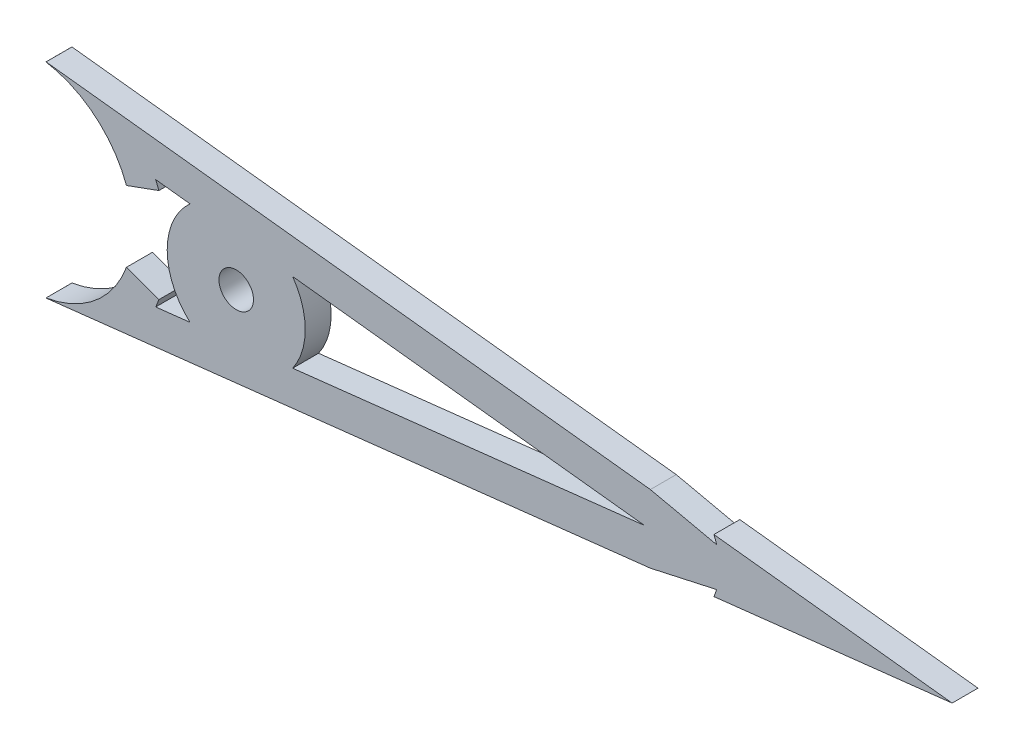
ISO-10303-21;
HEADER;
FILE_DESCRIPTION(('STEP AP214'),'2;1');
FILE_NAME('part.step','',(''),(''),'','','');
FILE_SCHEMA(('AUTOMOTIVE_DESIGN { 1 0 10303 214 1 1 1 1 }'));
ENDSEC;
DATA;
#1=APPLICATION_CONTEXT('core data for automotive mechanical design processes');
#2=APPLICATION_PROTOCOL_DEFINITION('international standard','automotive_design',2000,#1);
#3=PRODUCT_CONTEXT('',#1,'mechanical');
#4=PRODUCT('Part','Part','',(#3));
#5=PRODUCT_RELATED_PRODUCT_CATEGORY('part','',(#4));
#6=PRODUCT_DEFINITION_FORMATION('','',#4);
#7=PRODUCT_DEFINITION_CONTEXT('part definition',#1,'design');
#8=PRODUCT_DEFINITION('design','',#6,#7);
#9=PRODUCT_DEFINITION_SHAPE('','',#8);
#10=(LENGTH_UNIT() NAMED_UNIT(*) SI_UNIT(.MILLI.,.METRE.));
#11=(NAMED_UNIT(*) PLANE_ANGLE_UNIT() SI_UNIT($,.RADIAN.));
#12=(NAMED_UNIT(*) SI_UNIT($,.STERADIAN.) SOLID_ANGLE_UNIT());
#13=UNCERTAINTY_MEASURE_WITH_UNIT(LENGTH_MEASURE(1.E-05),#10,'distance_accuracy_value','');
#14=(GEOMETRIC_REPRESENTATION_CONTEXT(3) GLOBAL_UNCERTAINTY_ASSIGNED_CONTEXT((#13)) GLOBAL_UNIT_ASSIGNED_CONTEXT((#10,
#11,#12)) REPRESENTATION_CONTEXT('',''));
#15=CARTESIAN_POINT('',(0.,0.,0.));
#16=DIRECTION('',(0.,0.,1.));
#17=DIRECTION('',(1.,0.,0.));
#18=AXIS2_PLACEMENT_3D('',#15,#16,#17);
#19=CARTESIAN_POINT('',(-38.1,0.,-4.7625));
#20=DIRECTION('',(0.,0.,1.));
#21=DIRECTION('',(1.,0.,0.));
#22=AXIS2_PLACEMENT_3D('',#19,#20,#21);
#23=CYLINDRICAL_SURFACE('',#22,25.4);
#24=CARTESIAN_POINT('',(-38.1,0.,0.));
#25=DIRECTION('',(0.,0.,1.));
#26=DIRECTION('',(1.,0.,0.));
#27=AXIS2_PLACEMENT_3D('',#24,#25,#26);
#28=CIRCLE('',#27,25.4);
#29=CARTESIAN_POINT('',(-14.2318074320379,8.68731164047184,0.));
#30=VERTEX_POINT('',#29);
#31=CARTESIAN_POINT('',(-14.817170454314,10.1523321629333,0.));
#32=VERTEX_POINT('',#31);
#33=EDGE_CURVE('E248',#30,#32,#28,.T.);
#34=ORIENTED_EDGE('',*,*,#33,.F.);
#35=DIRECTION('',(0.,0.,1.));
#36=VECTOR('',#35,1.);
#37=CARTESIAN_POINT('',(-14.2318074320379,8.68731164047184,-4.7625));
#38=LINE('',#37,#36);
#39=CARTESIAN_POINT('',(-14.2318074320379,8.68731164047184,-4.7625));
#40=VERTEX_POINT('',#39);
#41=EDGE_CURVE('E383',#40,#30,#38,.T.);
#42=ORIENTED_EDGE('',*,*,#41,.F.);
#43=CARTESIAN_POINT('',(-38.1,0.,-4.7625));
#44=DIRECTION('',(0.,0.,1.));
#45=DIRECTION('',(1.,0.,0.));
#46=AXIS2_PLACEMENT_3D('',#43,#44,#45);
#47=CIRCLE('',#46,25.4);
#48=CARTESIAN_POINT('',(-14.817170454314,10.1523321629333,-4.7625));
#49=VERTEX_POINT('',#48);
#50=EDGE_CURVE('E252',#40,#49,#47,.T.);
#51=ORIENTED_EDGE('',*,*,#50,.T.);
#52=DIRECTION('',(0.,0.,1.));
#53=VECTOR('',#52,1.);
#54=CARTESIAN_POINT('',(-14.817170454314,10.1523321629333,-4.7625));
#55=LINE('',#54,#53);
#56=EDGE_CURVE('E318',#49,#32,#55,.T.);
#57=ORIENTED_EDGE('',*,*,#56,.T.);
#58=EDGE_LOOP('',(#34,#42,#51,#57));
#59=FACE_BOUND('',#58,.T.);
#60=ADVANCED_FACE('F49',(#59),#23,.T.);
#61=CARTESIAN_POINT('',(-20.1988555740284,6.51548373035388,-4.7625));
#62=DIRECTION('',(0.342020143325663,-0.93969262078591,0.));
#63=DIRECTION('',(0.939692620785911,0.342020143325663,0.));
#64=AXIS2_PLACEMENT_3D('',#61,#62,#63);
#65=PLANE('',#64);
#66=DIRECTION('',(0.93969262078591,0.342020143325663,0.));
#67=VECTOR('',#66,1.);
#68=CARTESIAN_POINT('',(-20.1988555740284,6.51548373035388,0.));
#69=LINE('',#68,#67);
#70=CARTESIAN_POINT('',(-20.1988555740284,6.51548373035388,0.));
#71=VERTEX_POINT('',#70);
#72=EDGE_CURVE('E257',#71,#30,#69,.T.);
#73=ORIENTED_EDGE('',*,*,#72,.F.);
#74=DIRECTION('',(0.,0.,1.));
#75=VECTOR('',#74,1.);
#76=CARTESIAN_POINT('',(-20.1988555740284,6.51548373035388,-4.7625));
#77=LINE('',#76,#75);
#78=CARTESIAN_POINT('',(-20.1988555740284,6.51548373035388,-4.7625));
#79=VERTEX_POINT('',#78);
#80=EDGE_CURVE('E387',#79,#71,#77,.T.);
#81=ORIENTED_EDGE('',*,*,#80,.F.);
#82=DIRECTION('',(0.93969262078591,0.342020143325663,0.));
#83=VECTOR('',#82,1.);
#84=CARTESIAN_POINT('',(-20.1988555740284,6.51548373035388,-4.7625));
#85=LINE('',#84,#83);
#86=EDGE_CURVE('E314',#79,#40,#85,.T.);
#87=ORIENTED_EDGE('',*,*,#86,.T.);
#88=ORIENTED_EDGE('',*,*,#41,.T.);
#89=EDGE_LOOP('',(#73,#81,#87,#88));
#90=FACE_BOUND('',#89,.T.);
#91=ADVANCED_FACE('F482',(#90),#65,.T.);
#92=CARTESIAN_POINT('',(-38.1,0.,-4.7625));
#93=DIRECTION('',(0.,0.,1.));
#94=DIRECTION('',(1.,0.,0.));
#95=AXIS2_PLACEMENT_3D('',#92,#93,#94);
#96=CYLINDRICAL_SURFACE('',#95,19.05);
#97=CARTESIAN_POINT('',(-38.1,0.,0.));
#98=DIRECTION('',(0.,0.,-1.));
#99=DIRECTION('',(1.,0.,0.));
#100=AXIS2_PLACEMENT_3D('',#97,#98,#99);
#101=CIRCLE('',#100,19.05);
#102=CARTESIAN_POINT('',(-34.9890417711435,18.7942661175772,0.));
#103=VERTEX_POINT('',#102);
#104=EDGE_CURVE('E377',#103,#71,#101,.T.);
#105=ORIENTED_EDGE('',*,*,#104,.F.);
#106=DIRECTION('',(0.,0.,1.));
#107=VECTOR('',#106,1.);
#108=CARTESIAN_POINT('',(-34.9890417711435,18.7942661175772,-4.7625));
#109=LINE('',#108,#107);
#110=CARTESIAN_POINT('',(-34.9890417711435,18.7942661175772,-4.7625));
#111=VERTEX_POINT('',#110);
#112=EDGE_CURVE('E439',#103,#111,#109,.F.);
#113=ORIENTED_EDGE('',*,*,#112,.T.);
#114=CARTESIAN_POINT('',(-38.1,0.,-4.7625));
#115=DIRECTION('',(0.,0.,-1.));
#116=DIRECTION('',(1.,0.,0.));
#117=AXIS2_PLACEMENT_3D('',#114,#115,#116);
#118=CIRCLE('',#117,19.05);
#119=EDGE_CURVE('E311',#111,#79,#118,.T.);
#120=ORIENTED_EDGE('',*,*,#119,.T.);
#121=ORIENTED_EDGE('',*,*,#80,.T.);
#122=EDGE_LOOP('',(#105,#113,#120,#121));
#123=FACE_BOUND('',#122,.T.);
#124=ADVANCED_FACE('F530',(#123),#96,.F.);
#125=CARTESIAN_POINT('',(76.2,6.26799297339507,-4.7625));
#126=DIRECTION('',(0.112174693389171,0.99368850157534,0.));
#127=DIRECTION('',(-0.99368850157534,0.112174693389171,0.));
#128=AXIS2_PLACEMENT_3D('',#125,#126,#127);
#129=PLANE('',#128);
#130=DIRECTION('',(-0.99368850157534,0.112174693389171,0.));
#131=VECTOR('',#130,1.);
#132=CARTESIAN_POINT('',(76.2,6.26799297339507,-4.7625));
#133=LINE('',#132,#131);
#134=CARTESIAN_POINT('',(76.2,6.26799297339507,-4.7625));
#135=VERTEX_POINT('',#134);
#136=CARTESIAN_POINT('',(-34.985543180385,18.8194154722923,-4.7625));
#137=VERTEX_POINT('',#136);
#138=EDGE_CURVE('E307',#135,#137,#133,.T.);
#139=ORIENTED_EDGE('',*,*,#138,.T.);
#140=DIRECTION('',(0.,0.,1.));
#141=VECTOR('',#140,1.);
#142=CARTESIAN_POINT('',(-34.9855431803849,18.8194154722923,-4.7625));
#143=LINE('',#142,#141);
#144=CARTESIAN_POINT('',(-34.985543180385,18.8194154722923,0.));
#145=VERTEX_POINT('',#144);
#146=EDGE_CURVE('E386',#137,#145,#143,.T.);
#147=ORIENTED_EDGE('',*,*,#146,.T.);
#148=DIRECTION('',(-0.99368850157534,0.112174693389171,0.));
#149=VECTOR('',#148,1.);
#150=CARTESIAN_POINT('',(76.2,6.26799297339507,0.));
#151=LINE('',#150,#149);
#152=CARTESIAN_POINT('',(76.2,6.26799297339507,0.));
#153=VERTEX_POINT('',#152);
#154=EDGE_CURVE('E373',#153,#145,#151,.T.);
#155=ORIENTED_EDGE('',*,*,#154,.F.);
#156=DIRECTION('',(0.,0.,1.));
#157=VECTOR('',#156,1.);
#158=CARTESIAN_POINT('',(76.2,6.26799297339507,-4.7625));
#159=LINE('',#158,#157);
#160=EDGE_CURVE('E391',#135,#153,#159,.T.);
#161=ORIENTED_EDGE('',*,*,#160,.F.);
#162=EDGE_LOOP('',(#139,#147,#155,#161));
#163=FACE_BOUND('',#162,.T.);
#164=ADVANCED_FACE('F493',(#163),#129,.T.);
#165=CARTESIAN_POINT('',(76.2,6.26799297339507,-4.7625));
#166=DIRECTION('',(0.215428920718154,0.976519523674878,0.));
#167=DIRECTION('',(-0.976519523674878,0.215428920718154,0.));
#168=AXIS2_PLACEMENT_3D('',#165,#166,#167);
#169=PLANE('',#168);
#170=DIRECTION('',(-0.976519523674878,0.215428920718154,0.));
#171=VECTOR('',#170,1.);
#172=CARTESIAN_POINT('',(76.2,6.26799297339507,0.));
#173=LINE('',#172,#171);
#174=CARTESIAN_POINT('',(88.3850123983999,3.5798705075522,0.));
#175=VERTEX_POINT('',#174);
#176=EDGE_CURVE('E369',#175,#153,#173,.T.);
#177=ORIENTED_EDGE('',*,*,#176,.F.);
#178=DIRECTION('',(0.,0.,1.));
#179=VECTOR('',#178,1.);
#180=CARTESIAN_POINT('',(88.3850123983999,3.5798705075522,-4.7625));
#181=LINE('',#180,#179);
#182=CARTESIAN_POINT('',(88.3850123983999,3.5798705075522,-4.7625));
#183=VERTEX_POINT('',#182);
#184=EDGE_CURVE('E394',#183,#175,#181,.T.);
#185=ORIENTED_EDGE('',*,*,#184,.F.);
#186=DIRECTION('',(-0.976519523674878,0.215428920718154,0.));
#187=VECTOR('',#186,1.);
#188=CARTESIAN_POINT('',(76.2,6.26799297339507,-4.7625));
#189=LINE('',#188,#187);
#190=EDGE_CURVE('E303',#183,#135,#189,.T.);
#191=ORIENTED_EDGE('',*,*,#190,.T.);
#192=ORIENTED_EDGE('',*,*,#160,.T.);
#193=EDGE_LOOP('',(#177,#185,#191,#192));
#194=FACE_BOUND('',#193,.T.);
#195=ADVANCED_FACE('F498',(#194),#169,.T.);
#196=CARTESIAN_POINT('',(76.2,0.,-4.7625));
#197=DIRECTION('',(0.,0.,1.));
#198=DIRECTION('',(1.,0.,0.));
#199=AXIS2_PLACEMENT_3D('',#196,#197,#198);
#200=CYLINDRICAL_SURFACE('',#199,12.7);
#201=CARTESIAN_POINT('',(76.2,0.,0.));
#202=DIRECTION('',(0.,0.,-1.));
#203=DIRECTION('',(1.,0.,0.));
#204=AXIS2_PLACEMENT_3D('',#201,#202,#203);
#205=CIRCLE('',#204,12.7);
#206=CARTESIAN_POINT('',(87.8966374651163,4.94759254684929,0.));
#207=VERTEX_POINT('',#206);
#208=EDGE_CURVE('E365',#207,#175,#205,.T.);
#209=ORIENTED_EDGE('',*,*,#208,.F.);
#210=DIRECTION('',(0.,0.,1.));
#211=VECTOR('',#210,1.);
#212=CARTESIAN_POINT('',(87.8966374651163,4.94759254684929,-4.7625));
#213=LINE('',#212,#211);
#214=CARTESIAN_POINT('',(87.8966374651163,4.94759254684929,-4.7625));
#215=VERTEX_POINT('',#214);
#216=EDGE_CURVE('E397',#215,#207,#213,.T.);
#217=ORIENTED_EDGE('',*,*,#216,.F.);
#218=CARTESIAN_POINT('',(76.2,0.,-4.7625));
#219=DIRECTION('',(0.,0.,-1.));
#220=DIRECTION('',(1.,0.,0.));
#221=AXIS2_PLACEMENT_3D('',#218,#219,#220);
#222=CIRCLE('',#221,12.7);
#223=EDGE_CURVE('E299',#215,#183,#222,.T.);
#224=ORIENTED_EDGE('',*,*,#223,.T.);
#225=ORIENTED_EDGE('',*,*,#184,.T.);
#226=EDGE_LOOP('',(#209,#217,#224,#225));
#227=FACE_BOUND('',#226,.T.);
#228=ADVANCED_FACE('F503',(#227),#200,.F.);
#229=CARTESIAN_POINT('',(131.7244,0.,-4.7625));
#230=DIRECTION('',(0.112174693389171,0.993688501575341,0.));
#231=DIRECTION('',(-0.993688501575341,0.112174693389171,0.));
#232=AXIS2_PLACEMENT_3D('',#229,#230,#231);
#233=PLANE('',#232);
#234=DIRECTION('',(-0.99368850157534,0.112174693389171,0.));
#235=VECTOR('',#234,1.);
#236=CARTESIAN_POINT('',(131.7244,0.,0.));
#237=LINE('',#236,#235);
#238=CARTESIAN_POINT('',(131.7244,0.,0.));
#239=VERTEX_POINT('',#238);
#240=EDGE_CURVE('E361',#239,#207,#237,.T.);
#241=ORIENTED_EDGE('',*,*,#240,.F.);
#242=DIRECTION('',(0.,0.,1.));
#243=VECTOR('',#242,1.);
#244=CARTESIAN_POINT('',(131.7244,0.,-4.7625));
#245=LINE('',#244,#243);
#246=CARTESIAN_POINT('',(131.7244,0.,-4.7625));
#247=VERTEX_POINT('',#246);
#248=EDGE_CURVE('E400',#247,#239,#245,.T.);
#249=ORIENTED_EDGE('',*,*,#248,.F.);
#250=DIRECTION('',(-0.99368850157534,0.112174693389171,0.));
#251=VECTOR('',#250,1.);
#252=CARTESIAN_POINT('',(131.7244,0.,-4.7625));
#253=LINE('',#252,#251);
#254=EDGE_CURVE('E295',#247,#215,#253,.T.);
#255=ORIENTED_EDGE('',*,*,#254,.T.);
#256=ORIENTED_EDGE('',*,*,#216,.T.);
#257=EDGE_LOOP('',(#241,#249,#255,#256));
#258=FACE_BOUND('',#257,.T.);
#259=ADVANCED_FACE('F506',(#258),#233,.T.);
#260=CARTESIAN_POINT('',(131.7244,0.,-4.7625));
#261=DIRECTION('',(0.112174693389171,-0.993688501575341,0.));
#262=DIRECTION('',(0.99368850157534,0.112174693389171,0.));
#263=AXIS2_PLACEMENT_3D('',#260,#261,#262);
#264=PLANE('',#263);
#265=DIRECTION('',(0.99368850157534,0.112174693389171,0.));
#266=VECTOR('',#265,1.);
#267=CARTESIAN_POINT('',(131.7244,0.,0.));
#268=LINE('',#267,#266);
#269=CARTESIAN_POINT('',(87.8966374651163,-4.9475925468493,0.));
#270=VERTEX_POINT('',#269);
#271=EDGE_CURVE('E357',#270,#239,#268,.T.);
#272=ORIENTED_EDGE('',*,*,#271,.F.);
#273=DIRECTION('',(0.,0.,1.));
#274=VECTOR('',#273,1.);
#275=CARTESIAN_POINT('',(87.8966374651163,-4.9475925468493,-4.7625));
#276=LINE('',#275,#274);
#277=CARTESIAN_POINT('',(87.8966374651163,-4.9475925468493,-4.7625));
#278=VERTEX_POINT('',#277);
#279=EDGE_CURVE('E403',#278,#270,#276,.T.);
#280=ORIENTED_EDGE('',*,*,#279,.F.);
#281=DIRECTION('',(0.99368850157534,0.112174693389171,0.));
#282=VECTOR('',#281,1.);
#283=CARTESIAN_POINT('',(131.7244,0.,-4.7625));
#284=LINE('',#283,#282);
#285=EDGE_CURVE('E291',#278,#247,#284,.T.);
#286=ORIENTED_EDGE('',*,*,#285,.T.);
#287=ORIENTED_EDGE('',*,*,#248,.T.);
#288=EDGE_LOOP('',(#272,#280,#286,#287));
#289=FACE_BOUND('',#288,.T.);
#290=ADVANCED_FACE('F511',(#289),#264,.T.);
#291=CARTESIAN_POINT('',(76.2,0.,-4.7625));
#292=DIRECTION('',(0.,0.,1.));
#293=DIRECTION('',(1.,0.,0.));
#294=AXIS2_PLACEMENT_3D('',#291,#292,#293);
#295=CYLINDRICAL_SURFACE('',#294,12.7);
#296=CARTESIAN_POINT('',(76.2,0.,0.));
#297=DIRECTION('',(0.,0.,-1.));
#298=DIRECTION('',(1.,0.,0.));
#299=AXIS2_PLACEMENT_3D('',#296,#297,#298);
#300=CIRCLE('',#299,12.7);
#301=CARTESIAN_POINT('',(88.3850123983999,-3.5798705075522,0.));
#302=VERTEX_POINT('',#301);
#303=EDGE_CURVE('E353',#302,#270,#300,.T.);
#304=ORIENTED_EDGE('',*,*,#303,.F.);
#305=DIRECTION('',(0.,0.,1.));
#306=VECTOR('',#305,1.);
#307=CARTESIAN_POINT('',(88.3850123983999,-3.5798705075522,-4.7625));
#308=LINE('',#307,#306);
#309=CARTESIAN_POINT('',(88.3850123983999,-3.5798705075522,-4.7625));
#310=VERTEX_POINT('',#309);
#311=EDGE_CURVE('E406',#310,#302,#308,.T.);
#312=ORIENTED_EDGE('',*,*,#311,.F.);
#313=CARTESIAN_POINT('',(76.2,0.,-4.7625));
#314=DIRECTION('',(0.,0.,-1.));
#315=DIRECTION('',(1.,0.,0.));
#316=AXIS2_PLACEMENT_3D('',#313,#314,#315);
#317=CIRCLE('',#316,12.7);
#318=EDGE_CURVE('E287',#310,#278,#317,.T.);
#319=ORIENTED_EDGE('',*,*,#318,.T.);
#320=ORIENTED_EDGE('',*,*,#279,.T.);
#321=EDGE_LOOP('',(#304,#312,#319,#320));
#322=FACE_BOUND('',#321,.T.);
#323=ADVANCED_FACE('F514',(#322),#295,.F.);
#324=CARTESIAN_POINT('',(76.2,-6.26799297339507,-4.7625));
#325=DIRECTION('',(0.215428920718154,-0.976519523674878,0.));
#326=DIRECTION('',(0.976519523674878,0.215428920718154,0.));
#327=AXIS2_PLACEMENT_3D('',#324,#325,#326);
#328=PLANE('',#327);
#329=DIRECTION('',(0.976519523674878,0.215428920718154,0.));
#330=VECTOR('',#329,1.);
#331=CARTESIAN_POINT('',(76.2,-6.26799297339507,0.));
#332=LINE('',#331,#330);
#333=CARTESIAN_POINT('',(76.2,-6.26799297339507,0.));
#334=VERTEX_POINT('',#333);
#335=EDGE_CURVE('E349',#334,#302,#332,.T.);
#336=ORIENTED_EDGE('',*,*,#335,.F.);
#337=DIRECTION('',(0.,0.,1.));
#338=VECTOR('',#337,1.);
#339=CARTESIAN_POINT('',(76.2,-6.26799297339507,-4.7625));
#340=LINE('',#339,#338);
#341=CARTESIAN_POINT('',(76.2,-6.26799297339507,-4.7625));
#342=VERTEX_POINT('',#341);
#343=EDGE_CURVE('E409',#342,#334,#340,.T.);
#344=ORIENTED_EDGE('',*,*,#343,.F.);
#345=DIRECTION('',(0.976519523674878,0.215428920718154,0.));
#346=VECTOR('',#345,1.);
#347=CARTESIAN_POINT('',(76.2,-6.26799297339507,-4.7625));
#348=LINE('',#347,#346);
#349=EDGE_CURVE('E283',#342,#310,#348,.T.);
#350=ORIENTED_EDGE('',*,*,#349,.T.);
#351=ORIENTED_EDGE('',*,*,#311,.T.);
#352=EDGE_LOOP('',(#336,#344,#350,#351));
#353=FACE_BOUND('',#352,.T.);
#354=ADVANCED_FACE('F519',(#353),#328,.T.);
#355=CARTESIAN_POINT('',(76.2,-6.26799297339507,-4.7625));
#356=DIRECTION('',(0.112174693389171,-0.99368850157534,0.));
#357=DIRECTION('',(0.99368850157534,0.112174693389171,0.));
#358=AXIS2_PLACEMENT_3D('',#355,#356,#357);
#359=PLANE('',#358);
#360=DIRECTION('',(0.99368850157534,0.112174693389171,0.));
#361=VECTOR('',#360,1.);
#362=CARTESIAN_POINT('',(76.2,-6.26799297339507,0.));
#363=LINE('',#362,#361);
#364=CARTESIAN_POINT('',(-34.9855431803848,-18.8194154722922,0.));
#365=VERTEX_POINT('',#364);
#366=EDGE_CURVE('E346',#365,#334,#363,.T.);
#367=ORIENTED_EDGE('',*,*,#366,.F.);
#368=DIRECTION('',(0.,0.,1.));
#369=VECTOR('',#368,1.);
#370=CARTESIAN_POINT('',(-34.9855431803848,-18.8194154722922,-4.7625));
#371=LINE('',#370,#369);
#372=CARTESIAN_POINT('',(-34.9855431803848,-18.8194154722922,-4.7625));
#373=VERTEX_POINT('',#372);
#374=EDGE_CURVE('E11',#365,#373,#371,.F.);
#375=ORIENTED_EDGE('',*,*,#374,.T.);
#376=DIRECTION('',(0.99368850157534,0.112174693389171,0.));
#377=VECTOR('',#376,1.);
#378=CARTESIAN_POINT('',(76.2,-6.26799297339507,-4.7625));
#379=LINE('',#378,#377);
#380=EDGE_CURVE('E280',#373,#342,#379,.T.);
#381=ORIENTED_EDGE('',*,*,#380,.T.);
#382=ORIENTED_EDGE('',*,*,#343,.T.);
#383=EDGE_LOOP('',(#367,#375,#381,#382));
#384=FACE_BOUND('',#383,.T.);
#385=ADVANCED_FACE('F520',(#384),#359,.T.);
#386=CARTESIAN_POINT('',(-38.1,0.,-4.7625));
#387=DIRECTION('',(0.,0.,1.));
#388=DIRECTION('',(1.,0.,0.));
#389=AXIS2_PLACEMENT_3D('',#386,#387,#388);
#390=CYLINDRICAL_SURFACE('',#389,19.05);
#391=CARTESIAN_POINT('',(-38.1,0.,-4.7625));
#392=DIRECTION('',(0.,0.,-1.));
#393=DIRECTION('',(1.,0.,0.));
#394=AXIS2_PLACEMENT_3D('',#391,#392,#393);
#395=CIRCLE('',#394,19.05);
#396=CARTESIAN_POINT('',(-20.1988555740284,-6.51548373035388,-4.7625));
#397=VERTEX_POINT('',#396);
#398=CARTESIAN_POINT('',(-34.9890417711434,-18.7942661175772,-4.7625));
#399=VERTEX_POINT('',#398);
#400=EDGE_CURVE('E277',#397,#399,#395,.T.);
#401=ORIENTED_EDGE('',*,*,#400,.T.);
#402=DIRECTION('',(0.,0.,1.));
#403=VECTOR('',#402,1.);
#404=CARTESIAN_POINT('',(-34.9890417711434,-18.7942661175772,-4.7625));
#405=LINE('',#404,#403);
#406=CARTESIAN_POINT('',(-34.9890417711434,-18.7942661175772,0.));
#407=VERTEX_POINT('',#406);
#408=EDGE_CURVE('E58',#399,#407,#405,.T.);
#409=ORIENTED_EDGE('',*,*,#408,.T.);
#410=CARTESIAN_POINT('',(-38.1,0.,0.));
#411=DIRECTION('',(0.,0.,-1.));
#412=DIRECTION('',(1.,0.,0.));
#413=AXIS2_PLACEMENT_3D('',#410,#411,#412);
#414=CIRCLE('',#413,19.05);
#415=CARTESIAN_POINT('',(-20.1988555740284,-6.51548373035388,0.));
#416=VERTEX_POINT('',#415);
#417=EDGE_CURVE('E342',#416,#407,#414,.T.);
#418=ORIENTED_EDGE('',*,*,#417,.F.);
#419=DIRECTION('',(0.,0.,1.));
#420=VECTOR('',#419,1.);
#421=CARTESIAN_POINT('',(-20.1988555740284,-6.51548373035388,-4.7625));
#422=LINE('',#421,#420);
#423=EDGE_CURVE('E413',#397,#416,#422,.T.);
#424=ORIENTED_EDGE('',*,*,#423,.F.);
#425=EDGE_LOOP('',(#401,#409,#418,#424));
#426=FACE_BOUND('',#425,.T.);
#427=ADVANCED_FACE('F451',(#426),#390,.F.);
#428=CARTESIAN_POINT('',(-20.1988555740284,-6.51548373035388,-4.7625));
#429=DIRECTION('',(0.342020143325664,0.93969262078591,0.));
#430=DIRECTION('',(-0.93969262078591,0.342020143325664,0.));
#431=AXIS2_PLACEMENT_3D('',#428,#429,#430);
#432=PLANE('',#431);
#433=DIRECTION('',(-0.93969262078591,0.342020143325663,0.));
#434=VECTOR('',#433,1.);
#435=CARTESIAN_POINT('',(-20.1988555740284,-6.51548373035388,0.));
#436=LINE('',#435,#434);
#437=CARTESIAN_POINT('',(-14.2318074320379,-8.68731164047185,0.));
#438=VERTEX_POINT('',#437);
#439=EDGE_CURVE('E338',#438,#416,#436,.T.);
#440=ORIENTED_EDGE('',*,*,#439,.F.);
#441=DIRECTION('',(0.,0.,1.));
#442=VECTOR('',#441,1.);
#443=CARTESIAN_POINT('',(-14.2318074320379,-8.68731164047185,-4.7625));
#444=LINE('',#443,#442);
#445=CARTESIAN_POINT('',(-14.2318074320379,-8.68731164047185,-4.7625));
#446=VERTEX_POINT('',#445);
#447=EDGE_CURVE('E416',#446,#438,#444,.T.);
#448=ORIENTED_EDGE('',*,*,#447,.F.);
#449=DIRECTION('',(-0.93969262078591,0.342020143325663,0.));
#450=VECTOR('',#449,1.);
#451=CARTESIAN_POINT('',(-20.1988555740284,-6.51548373035388,-4.7625));
#452=LINE('',#451,#450);
#453=EDGE_CURVE('E273',#446,#397,#452,.T.);
#454=ORIENTED_EDGE('',*,*,#453,.T.);
#455=ORIENTED_EDGE('',*,*,#423,.T.);
#456=EDGE_LOOP('',(#440,#448,#454,#455));
#457=FACE_BOUND('',#456,.T.);
#458=ADVANCED_FACE('F458',(#457),#432,.T.);
#459=CARTESIAN_POINT('',(-38.1,0.,-4.7625));
#460=DIRECTION('',(0.,0.,1.));
#461=DIRECTION('',(1.,0.,0.));
#462=AXIS2_PLACEMENT_3D('',#459,#460,#461);
#463=CYLINDRICAL_SURFACE('',#462,25.4);
#464=CARTESIAN_POINT('',(-38.1,0.,0.));
#465=DIRECTION('',(0.,0.,1.));
#466=DIRECTION('',(1.,0.,0.));
#467=AXIS2_PLACEMENT_3D('',#464,#465,#466);
#468=CIRCLE('',#467,25.4);
#469=CARTESIAN_POINT('',(-14.817170454314,-10.1523321629333,0.));
#470=VERTEX_POINT('',#469);
#471=EDGE_CURVE('E334',#470,#438,#468,.T.);
#472=ORIENTED_EDGE('',*,*,#471,.F.);
#473=DIRECTION('',(0.,0.,1.));
#474=VECTOR('',#473,1.);
#475=CARTESIAN_POINT('',(-14.817170454314,-10.1523321629333,-4.7625));
#476=LINE('',#475,#474);
#477=CARTESIAN_POINT('',(-14.817170454314,-10.1523321629333,-4.7625));
#478=VERTEX_POINT('',#477);
#479=EDGE_CURVE('E419',#478,#470,#476,.T.);
#480=ORIENTED_EDGE('',*,*,#479,.F.);
#481=CARTESIAN_POINT('',(-38.1,0.,-4.7625));
#482=DIRECTION('',(0.,0.,1.));
#483=DIRECTION('',(1.,0.,0.));
#484=AXIS2_PLACEMENT_3D('',#481,#482,#483);
#485=CIRCLE('',#484,25.4);
#486=EDGE_CURVE('E269',#478,#446,#485,.T.);
#487=ORIENTED_EDGE('',*,*,#486,.T.);
#488=ORIENTED_EDGE('',*,*,#447,.T.);
#489=EDGE_LOOP('',(#472,#480,#487,#488));
#490=FACE_BOUND('',#489,.T.);
#491=ADVANCED_FACE('F464',(#490),#463,.T.);
#492=CARTESIAN_POINT('',(-8.49693729584271,-9.43885886061007,-4.7625));
#493=DIRECTION('',(-0.112174693389172,0.99368850157534,0.));
#494=DIRECTION('',(-0.99368850157534,-0.112174693389172,0.));
#495=AXIS2_PLACEMENT_3D('',#492,#493,#494);
#496=PLANE('',#495);
#497=DIRECTION('',(-0.99368850157534,-0.112174693389172,0.));
#498=VECTOR('',#497,1.);
#499=CARTESIAN_POINT('',(-8.49693729584271,-9.43885886061007,0.));
#500=LINE('',#499,#498);
#501=CARTESIAN_POINT('',(-8.49693729584271,-9.43885886061006,0.));
#502=VERTEX_POINT('',#501);
#503=EDGE_CURVE('E330',#502,#470,#500,.T.);
#504=ORIENTED_EDGE('',*,*,#503,.F.);
#505=DIRECTION('',(0.,0.,1.));
#506=VECTOR('',#505,1.);
#507=CARTESIAN_POINT('',(-8.49693729584271,-9.43885886061006,-4.7625));
#508=LINE('',#507,#506);
#509=CARTESIAN_POINT('',(-8.49693729584271,-9.43885886061006,-4.7625));
#510=VERTEX_POINT('',#509);
#511=EDGE_CURVE('E422',#510,#502,#508,.T.);
#512=ORIENTED_EDGE('',*,*,#511,.F.);
#513=DIRECTION('',(-0.99368850157534,-0.112174693389172,0.));
#514=VECTOR('',#513,1.);
#515=CARTESIAN_POINT('',(-8.49693729584271,-9.43885886061007,-4.7625));
#516=LINE('',#515,#514);
#517=EDGE_CURVE('E265',#510,#478,#516,.T.);
#518=ORIENTED_EDGE('',*,*,#517,.T.);
#519=ORIENTED_EDGE('',*,*,#479,.T.);
#520=EDGE_LOOP('',(#504,#512,#518,#519));
#521=FACE_BOUND('',#520,.T.);
#522=ADVANCED_FACE('F467',(#521),#496,.T.);
#523=CARTESIAN_POINT('',(0.,0.,-4.7625));
#524=DIRECTION('',(0.,0.,1.));
#525=DIRECTION('',(1.,0.,0.));
#526=AXIS2_PLACEMENT_3D('',#523,#524,#525);
#527=CYLINDRICAL_SURFACE('',#526,12.7);
#528=CARTESIAN_POINT('',(0.,0.,0.));
#529=DIRECTION('',(0.,0.,1.));
#530=DIRECTION('',(1.,0.,0.));
#531=AXIS2_PLACEMENT_3D('',#528,#529,#530);
#532=CIRCLE('',#531,12.7);
#533=CARTESIAN_POINT('',(-8.49693729584271,9.43885886061007,0.));
#534=VERTEX_POINT('',#533);
#535=EDGE_CURVE('E326',#534,#502,#532,.T.);
#536=ORIENTED_EDGE('',*,*,#535,.F.);
#537=DIRECTION('',(0.,0.,1.));
#538=VECTOR('',#537,1.);
#539=CARTESIAN_POINT('',(-8.49693729584271,9.43885886061007,-4.7625));
#540=LINE('',#539,#538);
#541=CARTESIAN_POINT('',(-8.49693729584271,9.43885886061007,-4.7625));
#542=VERTEX_POINT('',#541);
#543=EDGE_CURVE('E425',#542,#534,#540,.T.);
#544=ORIENTED_EDGE('',*,*,#543,.F.);
#545=CARTESIAN_POINT('',(0.,0.,-4.7625));
#546=DIRECTION('',(0.,0.,1.));
#547=DIRECTION('',(1.,0.,0.));
#548=AXIS2_PLACEMENT_3D('',#545,#546,#547);
#549=CIRCLE('',#548,12.7);
#550=EDGE_CURVE('E261',#542,#510,#549,.T.);
#551=ORIENTED_EDGE('',*,*,#550,.T.);
#552=ORIENTED_EDGE('',*,*,#511,.T.);
#553=EDGE_LOOP('',(#536,#544,#551,#552));
#554=FACE_BOUND('',#553,.T.);
#555=ADVANCED_FACE('F472',(#554),#527,.T.);
#556=CARTESIAN_POINT('',(-8.49693729584271,9.43885886061007,-4.7625));
#557=DIRECTION('',(-0.112174693389171,-0.99368850157534,0.));
#558=DIRECTION('',(0.99368850157534,-0.112174693389171,0.));
#559=AXIS2_PLACEMENT_3D('',#556,#557,#558);
#560=PLANE('',#559);
#561=DIRECTION('',(0.99368850157534,-0.112174693389171,0.));
#562=VECTOR('',#561,1.);
#563=CARTESIAN_POINT('',(-8.49693729584271,9.43885886061007,0.));
#564=LINE('',#563,#562);
#565=EDGE_CURVE('E322',#32,#534,#564,.T.);
#566=ORIENTED_EDGE('',*,*,#565,.F.);
#567=ORIENTED_EDGE('',*,*,#56,.F.);
#568=DIRECTION('',(0.99368850157534,-0.112174693389171,0.));
#569=VECTOR('',#568,1.);
#570=CARTESIAN_POINT('',(-8.49693729584271,9.43885886061007,-4.7625));
#571=LINE('',#570,#569);
#572=EDGE_CURVE('E256',#49,#542,#571,.T.);
#573=ORIENTED_EDGE('',*,*,#572,.T.);
#574=ORIENTED_EDGE('',*,*,#543,.T.);
#575=EDGE_LOOP('',(#566,#567,#573,#574));
#576=FACE_BOUND('',#575,.T.);
#577=ADVANCED_FACE('F475',(#576),#560,.T.);
#578=CARTESIAN_POINT('',(-38.1,0.,-4.7625));
#579=DIRECTION('',(0.,0.,1.));
#580=DIRECTION('',(1.,0.,0.));
#581=AXIS2_PLACEMENT_3D('',#578,#579,#580);
#582=PLANE('',#581);
#583=DIRECTION('',(-0.99368850157534,0.112174693389171,0.));
#584=VECTOR('',#583,1.);
#585=CARTESIAN_POINT('',(75.1162666666667,0.,-4.7625));
#586=LINE('',#585,#584);
#587=CARTESIAN_POINT('',(75.1162666666667,0.,-4.7625));
#588=VERTEX_POINT('',#587);
#589=CARTESIAN_POINT('',(10.3873375759517,7.30706631167539,-4.7625));
#590=VERTEX_POINT('',#589);
#591=EDGE_CURVE('E212',#588,#590,#586,.T.);
#592=ORIENTED_EDGE('',*,*,#591,.T.);
#593=CARTESIAN_POINT('',(0.,0.,-4.7625));
#594=DIRECTION('',(0.,0.,-1.));
#595=DIRECTION('',(1.,0.,0.));
#596=AXIS2_PLACEMENT_3D('',#593,#594,#595);
#597=CIRCLE('',#596,12.7);
#598=CARTESIAN_POINT('',(10.3873375759517,-7.30706631167539,-4.7625));
#599=VERTEX_POINT('',#598);
#600=EDGE_CURVE('E203',#590,#599,#597,.T.);
#601=ORIENTED_EDGE('',*,*,#600,.T.);
#602=DIRECTION('',(0.99368850157534,0.112174693389171,0.));
#603=VECTOR('',#602,1.);
#604=CARTESIAN_POINT('',(75.1162666666667,0.,-4.7625));
#605=LINE('',#604,#603);
#606=EDGE_CURVE('E216',#599,#588,#605,.T.);
#607=ORIENTED_EDGE('',*,*,#606,.T.);
#608=EDGE_LOOP('',(#592,#601,#607));
#609=FACE_BOUND('',#608,.T.);
#610=CARTESIAN_POINT('',(0.,0.,-4.7625));
#611=DIRECTION('',(0.,0.,1.));
#612=DIRECTION('',(1.,0.,0.));
#613=AXIS2_PLACEMENT_3D('',#610,#611,#612);
#614=CIRCLE('',#613,3.175);
#615=CARTESIAN_POINT('',(3.175,0.,-4.7625));
#616=VERTEX_POINT('',#615);
#617=EDGE_CURVE('E244',#616,#616,#614,.T.);
#618=ORIENTED_EDGE('',*,*,#617,.T.);
#619=EDGE_LOOP('',(#618));
#620=FACE_BOUND('',#619,.T.);
#621=ORIENTED_EDGE('',*,*,#119,.F.);
#622=CARTESIAN_POINT('',(-34.986967798991,18.8067956283222,-4.7625));
#623=DIRECTION('',(0.,0.,1.));
#624=DIRECTION('',(1.,0.,0.));
#625=AXIS2_PLACEMENT_3D('',#622,#623,#624);
#626=CIRCLE('',#625,0.0127);
#627=EDGE_CURVE('E444',#111,#137,#626,.F.);
#628=ORIENTED_EDGE('',*,*,#627,.T.);
#629=ORIENTED_EDGE('',*,*,#138,.F.);
#630=ORIENTED_EDGE('',*,*,#190,.F.);
#631=ORIENTED_EDGE('',*,*,#223,.F.);
#632=ORIENTED_EDGE('',*,*,#254,.F.);
#633=ORIENTED_EDGE('',*,*,#285,.F.);
#634=ORIENTED_EDGE('',*,*,#318,.F.);
#635=ORIENTED_EDGE('',*,*,#349,.F.);
#636=ORIENTED_EDGE('',*,*,#380,.F.);
#637=CARTESIAN_POINT('',(-34.9869677989908,-18.8067956283222,-4.7625));
#638=DIRECTION('',(0.,0.,1.));
#639=DIRECTION('',(1.,0.,0.));
#640=AXIS2_PLACEMENT_3D('',#637,#638,#639);
#641=CIRCLE('',#640,0.0127);
#642=EDGE_CURVE('E65',#373,#399,#641,.F.);
#643=ORIENTED_EDGE('',*,*,#642,.T.);
#644=ORIENTED_EDGE('',*,*,#400,.F.);
#645=ORIENTED_EDGE('',*,*,#453,.F.);
#646=ORIENTED_EDGE('',*,*,#486,.F.);
#647=ORIENTED_EDGE('',*,*,#517,.F.);
#648=ORIENTED_EDGE('',*,*,#550,.F.);
#649=ORIENTED_EDGE('',*,*,#572,.F.);
#650=ORIENTED_EDGE('',*,*,#50,.F.);
#651=ORIENTED_EDGE('',*,*,#86,.F.);
#652=EDGE_LOOP('',(#621,#628,#629,#630,#631,#632,#633,#634,#635,#636,#643,#644,#645,#646,#647,
#648,#649,#650,#651));
#653=FACE_BOUND('',#652,.T.);
#654=ADVANCED_FACE('F221',(#609,#620,#653),#582,.F.);
#655=CARTESIAN_POINT('',(-38.1,0.,0.));
#656=DIRECTION('',(0.,0.,1.));
#657=DIRECTION('',(1.,0.,0.));
#658=AXIS2_PLACEMENT_3D('',#655,#656,#657);
#659=PLANE('',#658);
#660=CARTESIAN_POINT('',(0.,0.,0.));
#661=DIRECTION('',(0.,0.,-1.));
#662=DIRECTION('',(1.,0.,0.));
#663=AXIS2_PLACEMENT_3D('',#660,#661,#662);
#664=CIRCLE('',#663,12.7);
#665=CARTESIAN_POINT('',(10.3873375759517,7.30706631167539,0.));
#666=VERTEX_POINT('',#665);
#667=CARTESIAN_POINT('',(10.3873375759517,-7.30706631167539,0.));
#668=VERTEX_POINT('',#667);
#669=EDGE_CURVE('E206',#666,#668,#664,.T.);
#670=ORIENTED_EDGE('',*,*,#669,.F.);
#671=DIRECTION('',(-0.99368850157534,0.112174693389171,0.));
#672=VECTOR('',#671,1.);
#673=CARTESIAN_POINT('',(75.1162666666667,0.,0.));
#674=LINE('',#673,#672);
#675=CARTESIAN_POINT('',(75.1162666666667,0.,0.));
#676=VERTEX_POINT('',#675);
#677=EDGE_CURVE('E224',#676,#666,#674,.T.);
#678=ORIENTED_EDGE('',*,*,#677,.F.);
#679=DIRECTION('',(0.99368850157534,0.112174693389171,0.));
#680=VECTOR('',#679,1.);
#681=CARTESIAN_POINT('',(75.1162666666667,0.,0.));
#682=LINE('',#681,#680);
#683=EDGE_CURVE('E229',#668,#676,#682,.T.);
#684=ORIENTED_EDGE('',*,*,#683,.F.);
#685=EDGE_LOOP('',(#670,#678,#684));
#686=FACE_BOUND('',#685,.T.);
#687=CARTESIAN_POINT('',(0.,0.,0.));
#688=DIRECTION('',(0.,0.,1.));
#689=DIRECTION('',(1.,0.,0.));
#690=AXIS2_PLACEMENT_3D('',#687,#688,#689);
#691=CIRCLE('',#690,3.175);
#692=CARTESIAN_POINT('',(3.175,0.,0.));
#693=VERTEX_POINT('',#692);
#694=EDGE_CURVE('E241',#693,#693,#691,.T.);
#695=ORIENTED_EDGE('',*,*,#694,.F.);
#696=EDGE_LOOP('',(#695));
#697=FACE_BOUND('',#696,.T.);
#698=ORIENTED_EDGE('',*,*,#154,.T.);
#699=CARTESIAN_POINT('',(-34.986967798991,18.8067956283222,0.));
#700=DIRECTION('',(0.,0.,1.));
#701=DIRECTION('',(1.,0.,0.));
#702=AXIS2_PLACEMENT_3D('',#699,#700,#701);
#703=CIRCLE('',#702,0.0127);
#704=EDGE_CURVE('E436',#145,#103,#703,.T.);
#705=ORIENTED_EDGE('',*,*,#704,.T.);
#706=ORIENTED_EDGE('',*,*,#104,.T.);
#707=ORIENTED_EDGE('',*,*,#72,.T.);
#708=ORIENTED_EDGE('',*,*,#33,.T.);
#709=ORIENTED_EDGE('',*,*,#565,.T.);
#710=ORIENTED_EDGE('',*,*,#535,.T.);
#711=ORIENTED_EDGE('',*,*,#503,.T.);
#712=ORIENTED_EDGE('',*,*,#471,.T.);
#713=ORIENTED_EDGE('',*,*,#439,.T.);
#714=ORIENTED_EDGE('',*,*,#417,.T.);
#715=CARTESIAN_POINT('',(-34.9869677989908,-18.8067956283222,0.));
#716=DIRECTION('',(0.,0.,1.));
#717=DIRECTION('',(1.,0.,0.));
#718=AXIS2_PLACEMENT_3D('',#715,#716,#717);
#719=CIRCLE('',#718,0.0127);
#720=EDGE_CURVE('E433',#407,#365,#719,.T.);
#721=ORIENTED_EDGE('',*,*,#720,.T.);
#722=ORIENTED_EDGE('',*,*,#366,.T.);
#723=ORIENTED_EDGE('',*,*,#335,.T.);
#724=ORIENTED_EDGE('',*,*,#303,.T.);
#725=ORIENTED_EDGE('',*,*,#271,.T.);
#726=ORIENTED_EDGE('',*,*,#240,.T.);
#727=ORIENTED_EDGE('',*,*,#208,.T.);
#728=ORIENTED_EDGE('',*,*,#176,.T.);
#729=EDGE_LOOP('',(#698,#705,#706,#707,#708,#709,#710,#711,#712,#713,#714,#721,#722,#723,#724,
#725,#726,#727,#728));
#730=FACE_BOUND('',#729,.T.);
#731=ADVANCED_FACE('F454',(#686,#697,#730),#659,.T.);
#732=CARTESIAN_POINT('',(0.,0.,-4.7625));
#733=DIRECTION('',(0.,0.,1.));
#734=DIRECTION('',(1.,0.,0.));
#735=AXIS2_PLACEMENT_3D('',#732,#733,#734);
#736=CYLINDRICAL_SURFACE('',#735,3.175);
#737=ORIENTED_EDGE('',*,*,#617,.F.);
#738=EDGE_LOOP('',(#737));
#739=FACE_BOUND('',#738,.T.);
#740=ORIENTED_EDGE('',*,*,#694,.T.);
#741=EDGE_LOOP('',(#740));
#742=FACE_BOUND('',#741,.T.);
#743=ADVANCED_FACE('F565',(#739,#742),#736,.F.);
#744=CARTESIAN_POINT('',(0.,0.,-4.7625));
#745=DIRECTION('',(0.,0.,1.));
#746=DIRECTION('',(1.,0.,0.));
#747=AXIS2_PLACEMENT_3D('',#744,#745,#746);
#748=CYLINDRICAL_SURFACE('',#747,12.7);
#749=ORIENTED_EDGE('',*,*,#669,.T.);
#750=DIRECTION('',(0.,0.,1.));
#751=VECTOR('',#750,1.);
#752=CARTESIAN_POINT('',(10.3873375759517,-7.30706631167539,-4.7625));
#753=LINE('',#752,#751);
#754=EDGE_CURVE('E199',#599,#668,#753,.T.);
#755=ORIENTED_EDGE('',*,*,#754,.F.);
#756=ORIENTED_EDGE('',*,*,#600,.F.);
#757=DIRECTION('',(0.,0.,1.));
#758=VECTOR('',#757,1.);
#759=CARTESIAN_POINT('',(10.3873375759517,7.30706631167539,-4.7625));
#760=LINE('',#759,#758);
#761=EDGE_CURVE('E238',#590,#666,#760,.T.);
#762=ORIENTED_EDGE('',*,*,#761,.T.);
#763=EDGE_LOOP('',(#749,#755,#756,#762));
#764=FACE_BOUND('',#763,.T.);
#765=ADVANCED_FACE('F201',(#764),#748,.T.);
#766=CARTESIAN_POINT('',(75.1162666666667,0.,-4.7625));
#767=DIRECTION('',(0.112174693389171,0.99368850157534,0.));
#768=DIRECTION('',(-0.99368850157534,0.112174693389171,0.));
#769=AXIS2_PLACEMENT_3D('',#766,#767,#768);
#770=PLANE('',#769);
#771=ORIENTED_EDGE('',*,*,#677,.T.);
#772=ORIENTED_EDGE('',*,*,#761,.F.);
#773=ORIENTED_EDGE('',*,*,#591,.F.);
#774=DIRECTION('',(0.,0.,1.));
#775=VECTOR('',#774,1.);
#776=CARTESIAN_POINT('',(75.1162666666667,0.,-4.7625));
#777=LINE('',#776,#775);
#778=EDGE_CURVE('E211',#588,#676,#777,.T.);
#779=ORIENTED_EDGE('',*,*,#778,.T.);
#780=EDGE_LOOP('',(#771,#772,#773,#779));
#781=FACE_BOUND('',#780,.T.);
#782=ADVANCED_FACE('F574',(#781),#770,.F.);
#783=CARTESIAN_POINT('',(75.1162666666667,0.,-4.7625));
#784=DIRECTION('',(0.112174693389171,-0.99368850157534,0.));
#785=DIRECTION('',(0.99368850157534,0.112174693389171,0.));
#786=AXIS2_PLACEMENT_3D('',#783,#784,#785);
#787=PLANE('',#786);
#788=ORIENTED_EDGE('',*,*,#683,.T.);
#789=ORIENTED_EDGE('',*,*,#778,.F.);
#790=ORIENTED_EDGE('',*,*,#606,.F.);
#791=ORIENTED_EDGE('',*,*,#754,.T.);
#792=EDGE_LOOP('',(#788,#789,#790,#791));
#793=FACE_BOUND('',#792,.T.);
#794=ADVANCED_FACE('F217',(#793),#787,.F.);
#795=CARTESIAN_POINT('',(-34.986967798991,18.8067956283222,-4.7625));
#796=DIRECTION('',(0.,0.,1.));
#797=DIRECTION('',(1.,0.,0.));
#798=AXIS2_PLACEMENT_3D('',#795,#796,#797);
#799=CYLINDRICAL_SURFACE('',#798,0.0127);
#800=ORIENTED_EDGE('',*,*,#627,.F.);
#801=ORIENTED_EDGE('',*,*,#112,.F.);
#802=ORIENTED_EDGE('',*,*,#704,.F.);
#803=ORIENTED_EDGE('',*,*,#146,.F.);
#804=EDGE_LOOP('',(#800,#801,#802,#803));
#805=FACE_BOUND('',#804,.T.);
#806=ADVANCED_FACE('F490',(#805),#799,.T.);
#807=CARTESIAN_POINT('',(-34.9869677989908,-18.8067956283222,-4.7625));
#808=DIRECTION('',(0.,0.,1.));
#809=DIRECTION('',(1.,0.,0.));
#810=AXIS2_PLACEMENT_3D('',#807,#808,#809);
#811=CYLINDRICAL_SURFACE('',#810,0.0127);
#812=ORIENTED_EDGE('',*,*,#642,.F.);
#813=ORIENTED_EDGE('',*,*,#374,.F.);
#814=ORIENTED_EDGE('',*,*,#720,.F.);
#815=ORIENTED_EDGE('',*,*,#408,.F.);
#816=EDGE_LOOP('',(#812,#813,#814,#815));
#817=FACE_BOUND('',#816,.T.);
#818=ADVANCED_FACE('F51',(#817),#811,.T.);
#819=CLOSED_SHELL('',(#60,#91,#124,#164,#195,#228,#259,#290,#323,#354,#385,#427,#458,#491,#522,
#555,#577,#654,#731,#743,#765,#782,#794,#806,#818));
#820=MANIFOLD_SOLID_BREP('B2',#819);
#821=ADVANCED_BREP_SHAPE_REPRESENTATION('',(#18,#820),#14);
#822=SHAPE_DEFINITION_REPRESENTATION(#9,#821);
ENDSEC;
END-ISO-10303-21;
